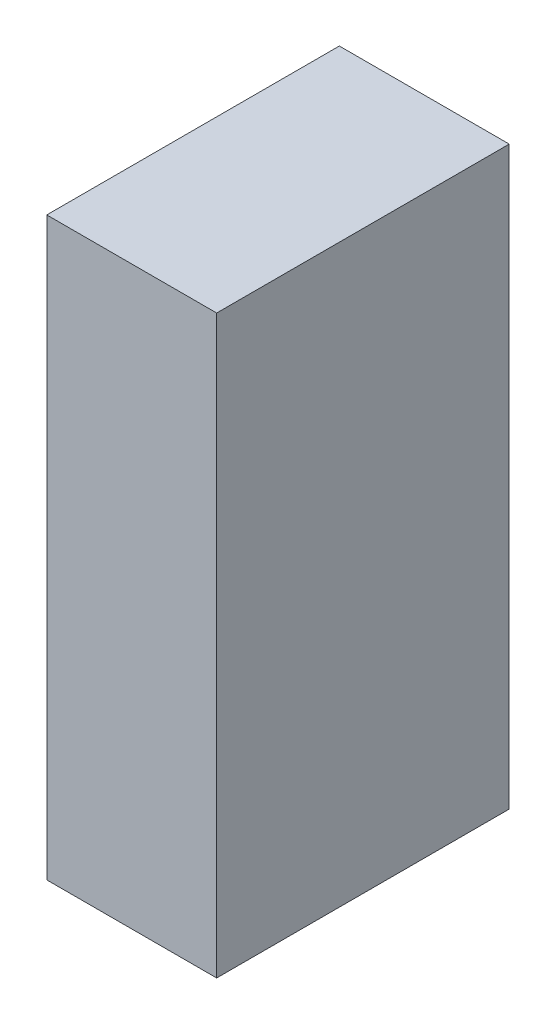
ISO-10303-21;
HEADER;
FILE_DESCRIPTION(('STEP AP214'),'2;1');
FILE_NAME('part.step','',(''),(''),'','','');
FILE_SCHEMA(('AUTOMOTIVE_DESIGN { 1 0 10303 214 1 1 1 1 }'));
ENDSEC;
DATA;
#1=APPLICATION_CONTEXT('core data for automotive mechanical design processes');
#2=APPLICATION_PROTOCOL_DEFINITION('international standard','automotive_design',2000,#1);
#3=PRODUCT_CONTEXT('',#1,'mechanical');
#4=PRODUCT('Part','Part','',(#3));
#5=PRODUCT_RELATED_PRODUCT_CATEGORY('part','',(#4));
#6=PRODUCT_DEFINITION_FORMATION('','',#4);
#7=PRODUCT_DEFINITION_CONTEXT('part definition',#1,'design');
#8=PRODUCT_DEFINITION('design','',#6,#7);
#9=PRODUCT_DEFINITION_SHAPE('','',#8);
#10=(LENGTH_UNIT() NAMED_UNIT(*) SI_UNIT(.MILLI.,.METRE.));
#11=(NAMED_UNIT(*) PLANE_ANGLE_UNIT() SI_UNIT($,.RADIAN.));
#12=(NAMED_UNIT(*) SI_UNIT($,.STERADIAN.) SOLID_ANGLE_UNIT());
#13=UNCERTAINTY_MEASURE_WITH_UNIT(LENGTH_MEASURE(1.E-05),#10,'distance_accuracy_value','');
#14=(GEOMETRIC_REPRESENTATION_CONTEXT(3) GLOBAL_UNCERTAINTY_ASSIGNED_CONTEXT((#13)) GLOBAL_UNIT_ASSIGNED_CONTEXT((#10,
#11,#12)) REPRESENTATION_CONTEXT('',''));
#15=CARTESIAN_POINT('',(0.,0.,0.));
#16=DIRECTION('',(0.,0.,1.));
#17=DIRECTION('',(1.,0.,0.));
#18=AXIS2_PLACEMENT_3D('',#15,#16,#17);
#19=CARTESIAN_POINT('',(0.14750034,-0.499999,0.508));
#20=DIRECTION('',(0.,0.,-1.));
#21=DIRECTION('',(0.,-1.,0.));
#22=AXIS2_PLACEMENT_3D('',#19,#20,#21);
#23=PLANE('',#22);
#24=DIRECTION('',(0.,1.,0.));
#25=VECTOR('',#24,1.);
#26=CARTESIAN_POINT('',(0.14750034,-0.499999,0.508));
#27=LINE('',#26,#25);
#28=CARTESIAN_POINT('',(0.14750034,-0.499999,0.508));
#29=VERTEX_POINT('',#28);
#30=CARTESIAN_POINT('',(0.14750034,0.499999,0.508));
#31=VERTEX_POINT('',#30);
#32=EDGE_CURVE('E91',#29,#31,#27,.T.);
#33=ORIENTED_EDGE('',*,*,#32,.T.);
#34=DIRECTION('',(-1.,0.,0.));
#35=VECTOR('',#34,1.);
#36=CARTESIAN_POINT('',(0.14750034,0.499999,0.508));
#37=LINE('',#36,#35);
#38=CARTESIAN_POINT('',(-0.1474978,0.499999,0.508));
#39=VERTEX_POINT('',#38);
#40=EDGE_CURVE('E76',#31,#39,#37,.T.);
#41=ORIENTED_EDGE('',*,*,#40,.T.);
#42=DIRECTION('',(0.,-1.,0.));
#43=VECTOR('',#42,1.);
#44=CARTESIAN_POINT('',(-0.1474978,0.499999,0.508));
#45=LINE('',#44,#43);
#46=CARTESIAN_POINT('',(-0.1474978,-0.499999,0.508));
#47=VERTEX_POINT('',#46);
#48=EDGE_CURVE('E81',#39,#47,#45,.T.);
#49=ORIENTED_EDGE('',*,*,#48,.T.);
#50=DIRECTION('',(1.,0.,0.));
#51=VECTOR('',#50,1.);
#52=CARTESIAN_POINT('',(-0.1474978,-0.499999,0.508));
#53=LINE('',#52,#51);
#54=EDGE_CURVE('E11',#47,#29,#53,.T.);
#55=ORIENTED_EDGE('',*,*,#54,.T.);
#56=EDGE_LOOP('',(#33,#41,#49,#55));
#57=FACE_BOUND('',#56,.T.);
#58=ADVANCED_FACE('F17',(#57),#23,.F.);
#59=CARTESIAN_POINT('',(0.14750034,-0.499999,0.));
#60=DIRECTION('',(0.,0.,-1.));
#61=DIRECTION('',(0.,-1.,0.));
#62=AXIS2_PLACEMENT_3D('',#59,#60,#61);
#63=PLANE('',#62);
#64=DIRECTION('',(0.,1.,0.));
#65=VECTOR('',#64,1.);
#66=CARTESIAN_POINT('',(0.14750034,-0.499999,0.));
#67=LINE('',#66,#65);
#68=CARTESIAN_POINT('',(0.14750034,-0.499999,0.));
#69=VERTEX_POINT('',#68);
#70=CARTESIAN_POINT('',(0.14750034,0.499999,0.));
#71=VERTEX_POINT('',#70);
#72=EDGE_CURVE('E102',#69,#71,#67,.T.);
#73=ORIENTED_EDGE('',*,*,#72,.F.);
#74=DIRECTION('',(1.,0.,0.));
#75=VECTOR('',#74,1.);
#76=CARTESIAN_POINT('',(-0.1474978,-0.499999,0.));
#77=LINE('',#76,#75);
#78=CARTESIAN_POINT('',(-0.1474978,-0.499999,0.));
#79=VERTEX_POINT('',#78);
#80=EDGE_CURVE('E20',#79,#69,#77,.T.);
#81=ORIENTED_EDGE('',*,*,#80,.F.);
#82=DIRECTION('',(0.,-1.,0.));
#83=VECTOR('',#82,1.);
#84=CARTESIAN_POINT('',(-0.1474978,0.499999,0.));
#85=LINE('',#84,#83);
#86=CARTESIAN_POINT('',(-0.1474978,0.499999,0.));
#87=VERTEX_POINT('',#86);
#88=EDGE_CURVE('E65',#87,#79,#85,.T.);
#89=ORIENTED_EDGE('',*,*,#88,.F.);
#90=DIRECTION('',(-1.,0.,0.));
#91=VECTOR('',#90,1.);
#92=CARTESIAN_POINT('',(0.14750034,0.499999,0.));
#93=LINE('',#92,#91);
#94=EDGE_CURVE('E70',#71,#87,#93,.T.);
#95=ORIENTED_EDGE('',*,*,#94,.F.);
#96=EDGE_LOOP('',(#73,#81,#89,#95));
#97=FACE_BOUND('',#96,.T.);
#98=ADVANCED_FACE('F68',(#97),#63,.T.);
#99=CARTESIAN_POINT('',(-0.1474978,-0.499999,0.));
#100=DIRECTION('',(0.,1.,0.));
#101=DIRECTION('',(1.,0.,0.));
#102=AXIS2_PLACEMENT_3D('',#99,#100,#101);
#103=PLANE('',#102);
#104=DIRECTION('',(0.,0.,1.));
#105=VECTOR('',#104,1.);
#106=CARTESIAN_POINT('',(-0.1474978,-0.499999,0.));
#107=LINE('',#106,#105);
#108=EDGE_CURVE('E75',#79,#47,#107,.T.);
#109=ORIENTED_EDGE('',*,*,#108,.F.);
#110=ORIENTED_EDGE('',*,*,#80,.T.);
#111=DIRECTION('',(0.,0.,1.));
#112=VECTOR('',#111,1.);
#113=CARTESIAN_POINT('',(0.14750034,-0.499999,0.));
#114=LINE('',#113,#112);
#115=EDGE_CURVE('E104',#69,#29,#114,.T.);
#116=ORIENTED_EDGE('',*,*,#115,.T.);
#117=ORIENTED_EDGE('',*,*,#54,.F.);
#118=EDGE_LOOP('',(#109,#110,#116,#117));
#119=FACE_BOUND('',#118,.T.);
#120=ADVANCED_FACE('F113',(#119),#103,.F.);
#121=CARTESIAN_POINT('',(-0.1474978,0.499999,0.));
#122=DIRECTION('',(1.,0.,0.));
#123=DIRECTION('',(0.,1.,0.));
#124=AXIS2_PLACEMENT_3D('',#121,#122,#123);
#125=PLANE('',#124);
#126=DIRECTION('',(0.,0.,1.));
#127=VECTOR('',#126,1.);
#128=CARTESIAN_POINT('',(-0.1474978,0.499999,0.));
#129=LINE('',#128,#127);
#130=EDGE_CURVE('E79',#87,#39,#129,.T.);
#131=ORIENTED_EDGE('',*,*,#130,.F.);
#132=ORIENTED_EDGE('',*,*,#88,.T.);
#133=ORIENTED_EDGE('',*,*,#108,.T.);
#134=ORIENTED_EDGE('',*,*,#48,.F.);
#135=EDGE_LOOP('',(#131,#132,#133,#134));
#136=FACE_BOUND('',#135,.T.);
#137=ADVANCED_FACE('F80',(#136),#125,.F.);
#138=CARTESIAN_POINT('',(0.14750034,0.499999,0.));
#139=DIRECTION('',(0.,-1.,0.));
#140=DIRECTION('',(0.,0.,-1.));
#141=AXIS2_PLACEMENT_3D('',#138,#139,#140);
#142=PLANE('',#141);
#143=DIRECTION('',(0.,0.,1.));
#144=VECTOR('',#143,1.);
#145=CARTESIAN_POINT('',(0.14750034,0.499999,0.));
#146=LINE('',#145,#144);
#147=EDGE_CURVE('E88',#71,#31,#146,.T.);
#148=ORIENTED_EDGE('',*,*,#147,.F.);
#149=ORIENTED_EDGE('',*,*,#94,.T.);
#150=ORIENTED_EDGE('',*,*,#130,.T.);
#151=ORIENTED_EDGE('',*,*,#40,.F.);
#152=EDGE_LOOP('',(#148,#149,#150,#151));
#153=FACE_BOUND('',#152,.T.);
#154=ADVANCED_FACE('F86',(#153),#142,.F.);
#155=CARTESIAN_POINT('',(0.14750034,-0.499999,0.));
#156=DIRECTION('',(-1.,0.,0.));
#157=DIRECTION('',(0.,0.,1.));
#158=AXIS2_PLACEMENT_3D('',#155,#156,#157);
#159=PLANE('',#158);
#160=ORIENTED_EDGE('',*,*,#115,.F.);
#161=ORIENTED_EDGE('',*,*,#72,.T.);
#162=ORIENTED_EDGE('',*,*,#147,.T.);
#163=ORIENTED_EDGE('',*,*,#32,.F.);
#164=EDGE_LOOP('',(#160,#161,#162,#163));
#165=FACE_BOUND('',#164,.T.);
#166=ADVANCED_FACE('F119',(#165),#159,.F.);
#167=CLOSED_SHELL('',(#58,#98,#120,#137,#154,#166));
#168=MANIFOLD_SOLID_BREP('B1',#167);
#169=ADVANCED_BREP_SHAPE_REPRESENTATION('',(#18,#168),#14);
#170=SHAPE_DEFINITION_REPRESENTATION(#9,#169);
ENDSEC;
END-ISO-10303-21;
